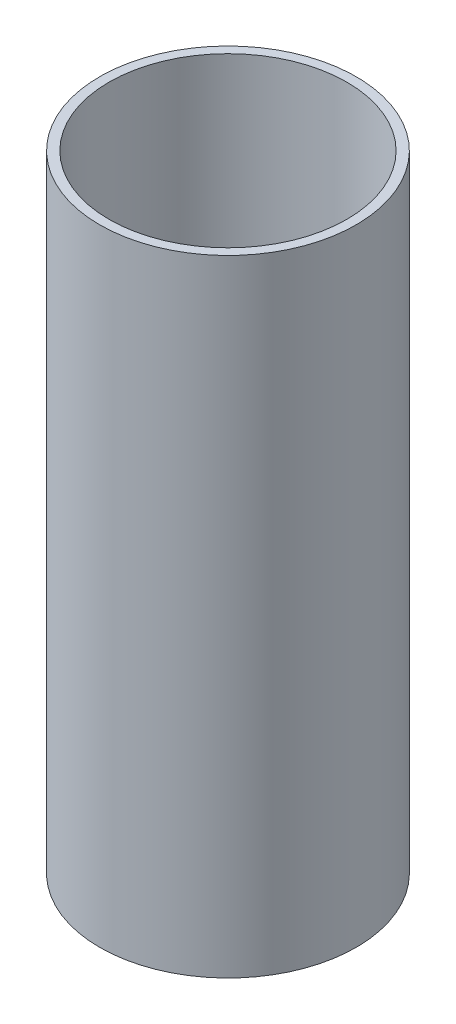
ISO-10303-21;
HEADER;
FILE_DESCRIPTION(('STEP AP214'),'2;1');
FILE_NAME('part.step','',(''),(''),'','','');
FILE_SCHEMA(('AUTOMOTIVE_DESIGN { 1 0 10303 214 1 1 1 1 }'));
ENDSEC;
DATA;
#1=APPLICATION_CONTEXT('core data for automotive mechanical design processes');
#2=APPLICATION_PROTOCOL_DEFINITION('international standard','automotive_design',2000,#1);
#3=PRODUCT_CONTEXT('',#1,'mechanical');
#4=PRODUCT('Part','Part','',(#3));
#5=PRODUCT_RELATED_PRODUCT_CATEGORY('part','',(#4));
#6=PRODUCT_DEFINITION_FORMATION('','',#4);
#7=PRODUCT_DEFINITION_CONTEXT('part definition',#1,'design');
#8=PRODUCT_DEFINITION('design','',#6,#7);
#9=PRODUCT_DEFINITION_SHAPE('','',#8);
#10=(LENGTH_UNIT() NAMED_UNIT(*) SI_UNIT(.MILLI.,.METRE.));
#11=(NAMED_UNIT(*) PLANE_ANGLE_UNIT() SI_UNIT($,.RADIAN.));
#12=(NAMED_UNIT(*) SI_UNIT($,.STERADIAN.) SOLID_ANGLE_UNIT());
#13=UNCERTAINTY_MEASURE_WITH_UNIT(LENGTH_MEASURE(1.E-05),#10,'distance_accuracy_value','');
#14=(GEOMETRIC_REPRESENTATION_CONTEXT(3) GLOBAL_UNCERTAINTY_ASSIGNED_CONTEXT((#13)) GLOBAL_UNIT_ASSIGNED_CONTEXT((#10,
#11,#12)) REPRESENTATION_CONTEXT('',''));
#15=CARTESIAN_POINT('',(0.,0.,0.));
#16=DIRECTION('',(0.,0.,1.));
#17=DIRECTION('',(1.,0.,0.));
#18=AXIS2_PLACEMENT_3D('',#15,#16,#17);
#19=CARTESIAN_POINT('',(0.,100.,0.));
#20=DIRECTION('',(0.,1.,0.));
#21=DIRECTION('',(0.,0.,1.));
#22=AXIS2_PLACEMENT_3D('',#19,#20,#21);
#23=PLANE('',#22);
#24=CARTESIAN_POINT('',(0.,100.,0.));
#25=DIRECTION('',(0.,1.,0.));
#26=DIRECTION('',(0.,0.,1.));
#27=AXIS2_PLACEMENT_3D('',#24,#25,#26);
#28=CIRCLE('',#27,20.5);
#29=CARTESIAN_POINT('',(0.,100.,20.5));
#30=VERTEX_POINT('',#29);
#31=EDGE_CURVE('E10',#30,#30,#28,.T.);
#32=ORIENTED_EDGE('',*,*,#31,.T.);
#33=EDGE_LOOP('',(#32));
#34=FACE_BOUND('',#33,.T.);
#35=CARTESIAN_POINT('',(0.,100.,0.));
#36=DIRECTION('',(0.,1.,0.));
#37=DIRECTION('',(0.,0.,1.));
#38=AXIS2_PLACEMENT_3D('',#35,#36,#37);
#39=CIRCLE('',#38,19.);
#40=CARTESIAN_POINT('',(0.,100.,19.));
#41=VERTEX_POINT('',#40);
#42=EDGE_CURVE('E48',#41,#41,#39,.T.);
#43=ORIENTED_EDGE('',*,*,#42,.F.);
#44=EDGE_LOOP('',(#43));
#45=FACE_BOUND('',#44,.T.);
#46=ADVANCED_FACE('F37',(#34,#45),#23,.T.);
#47=CARTESIAN_POINT('',(0.,0.,0.));
#48=DIRECTION('',(0.,1.,0.));
#49=DIRECTION('',(0.,0.,1.));
#50=AXIS2_PLACEMENT_3D('',#47,#48,#49);
#51=PLANE('',#50);
#52=CARTESIAN_POINT('',(0.,0.,0.));
#53=DIRECTION('',(0.,1.,0.));
#54=DIRECTION('',(0.,0.,1.));
#55=AXIS2_PLACEMENT_3D('',#52,#53,#54);
#56=CIRCLE('',#55,20.5);
#57=CARTESIAN_POINT('',(0.,0.,20.5));
#58=VERTEX_POINT('',#57);
#59=EDGE_CURVE('E41',#58,#58,#56,.T.);
#60=ORIENTED_EDGE('',*,*,#59,.F.);
#61=EDGE_LOOP('',(#60));
#62=FACE_BOUND('',#61,.T.);
#63=CARTESIAN_POINT('',(0.,0.,0.));
#64=DIRECTION('',(0.,1.,0.));
#65=DIRECTION('',(0.,0.,1.));
#66=AXIS2_PLACEMENT_3D('',#63,#64,#65);
#67=CIRCLE('',#66,19.);
#68=CARTESIAN_POINT('',(0.,0.,19.));
#69=VERTEX_POINT('',#68);
#70=EDGE_CURVE('E50',#69,#69,#67,.T.);
#71=ORIENTED_EDGE('',*,*,#70,.T.);
#72=EDGE_LOOP('',(#71));
#73=FACE_BOUND('',#72,.T.);
#74=ADVANCED_FACE('F60',(#62,#73),#51,.F.);
#75=CARTESIAN_POINT('',(0.,100.,0.));
#76=DIRECTION('',(0.,-1.,0.));
#77=DIRECTION('',(0.,0.,-1.));
#78=AXIS2_PLACEMENT_3D('',#75,#76,#77);
#79=CYLINDRICAL_SURFACE('',#78,20.5);
#80=ORIENTED_EDGE('',*,*,#31,.F.);
#81=EDGE_LOOP('',(#80));
#82=FACE_BOUND('',#81,.T.);
#83=ORIENTED_EDGE('',*,*,#59,.T.);
#84=EDGE_LOOP('',(#83));
#85=FACE_BOUND('',#84,.T.);
#86=ADVANCED_FACE('F39',(#82,#85),#79,.T.);
#87=CARTESIAN_POINT('',(0.,100.,0.));
#88=DIRECTION('',(0.,-1.,0.));
#89=DIRECTION('',(0.,0.,-1.));
#90=AXIS2_PLACEMENT_3D('',#87,#88,#89);
#91=CYLINDRICAL_SURFACE('',#90,19.);
#92=ORIENTED_EDGE('',*,*,#42,.T.);
#93=EDGE_LOOP('',(#92));
#94=FACE_BOUND('',#93,.T.);
#95=ORIENTED_EDGE('',*,*,#70,.F.);
#96=EDGE_LOOP('',(#95));
#97=FACE_BOUND('',#96,.T.);
#98=ADVANCED_FACE('F56',(#94,#97),#91,.F.);
#99=CLOSED_SHELL('',(#46,#74,#86,#98));
#100=MANIFOLD_SOLID_BREP('B2',#99);
#101=ADVANCED_BREP_SHAPE_REPRESENTATION('',(#18,#100),#14);
#102=SHAPE_DEFINITION_REPRESENTATION(#9,#101);
ENDSEC;
END-ISO-10303-21;
